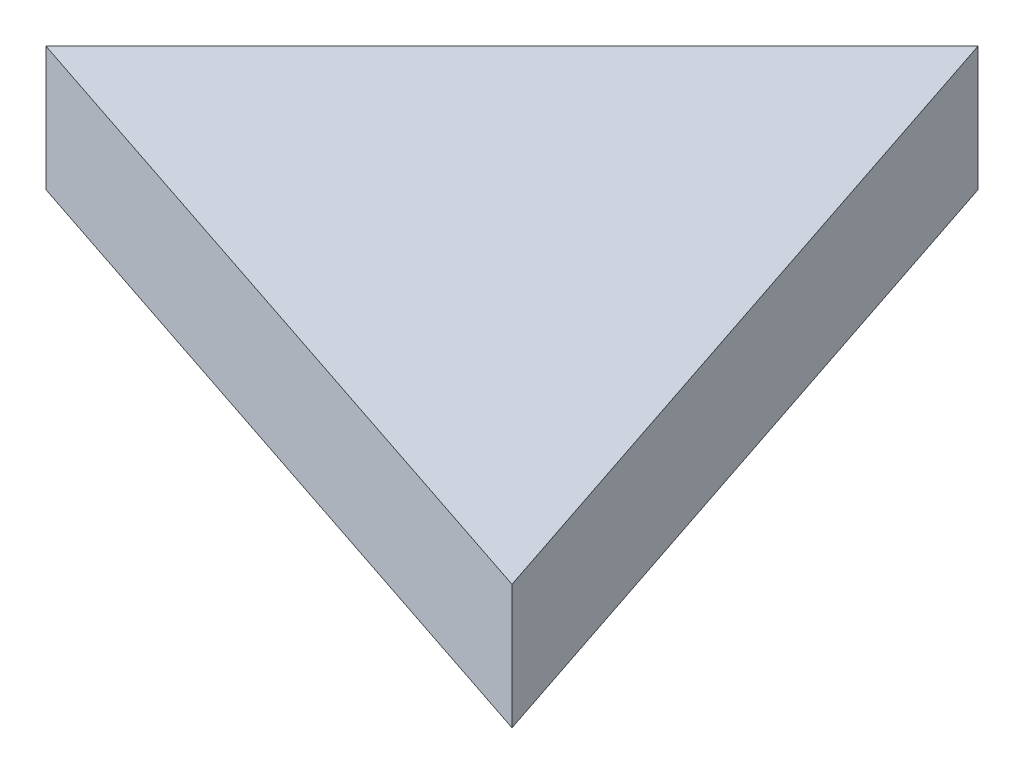
ISO-10303-21;
HEADER;
FILE_DESCRIPTION(('STEP AP214'),'2;1');
FILE_NAME('part.step','',(''),(''),'','','');
FILE_SCHEMA(('AUTOMOTIVE_DESIGN { 1 0 10303 214 1 1 1 1 }'));
ENDSEC;
DATA;
#1=APPLICATION_CONTEXT('core data for automotive mechanical design processes');
#2=APPLICATION_PROTOCOL_DEFINITION('international standard','automotive_design',2000,#1);
#3=PRODUCT_CONTEXT('',#1,'mechanical');
#4=PRODUCT('Part','Part','',(#3));
#5=PRODUCT_RELATED_PRODUCT_CATEGORY('part','',(#4));
#6=PRODUCT_DEFINITION_FORMATION('','',#4);
#7=PRODUCT_DEFINITION_CONTEXT('part definition',#1,'design');
#8=PRODUCT_DEFINITION('design','',#6,#7);
#9=PRODUCT_DEFINITION_SHAPE('','',#8);
#10=(LENGTH_UNIT() NAMED_UNIT(*) SI_UNIT(.MILLI.,.METRE.));
#11=(NAMED_UNIT(*) PLANE_ANGLE_UNIT() SI_UNIT($,.RADIAN.));
#12=(NAMED_UNIT(*) SI_UNIT($,.STERADIAN.) SOLID_ANGLE_UNIT());
#13=UNCERTAINTY_MEASURE_WITH_UNIT(LENGTH_MEASURE(1.E-05),#10,'distance_accuracy_value','');
#14=(GEOMETRIC_REPRESENTATION_CONTEXT(3) GLOBAL_UNCERTAINTY_ASSIGNED_CONTEXT((#13)) GLOBAL_UNIT_ASSIGNED_CONTEXT((#10,
#11,#12)) REPRESENTATION_CONTEXT('',''));
#15=CARTESIAN_POINT('',(0.,0.,0.));
#16=DIRECTION('',(0.,0.,1.));
#17=DIRECTION('',(1.,0.,0.));
#18=AXIS2_PLACEMENT_3D('',#15,#16,#17);
#19=CARTESIAN_POINT('',(0.,0.,0.));
#20=DIRECTION('',(0.,1.,0.));
#21=DIRECTION('',(0.,0.,1.));
#22=AXIS2_PLACEMENT_3D('',#19,#20,#21);
#23=PLANE('',#22);
#24=DIRECTION('',(-0.707106781186548,0.,0.707106781186548));
#25=VECTOR('',#24,1.);
#26=CARTESIAN_POINT('',(-10.,0.,-10.));
#27=LINE('',#26,#25);
#28=CARTESIAN_POINT('',(52.,0.,-72.));
#29=VERTEX_POINT('',#28);
#30=CARTESIAN_POINT('',(28.0000000000001,0.,-48.0000000000001));
#31=VERTEX_POINT('',#30);
#32=EDGE_CURVE('E52',#29,#31,#27,.T.);
#33=ORIENTED_EDGE('',*,*,#32,.F.);
#34=DIRECTION('',(0.316227766016841,0.,0.948683298050513));
#35=VECTOR('',#34,1.);
#36=CARTESIAN_POINT('',(68.4000000000001,0.,-22.8000000000003));
#37=LINE('',#36,#35);
#38=CARTESIAN_POINT('',(64.0000000000001,0.,-36.));
#39=VERTEX_POINT('',#38);
#40=EDGE_CURVE('E53',#29,#39,#37,.T.);
#41=ORIENTED_EDGE('',*,*,#40,.T.);
#42=DIRECTION('',(-0.948683298050513,0.,-0.316227766016841));
#43=VECTOR('',#42,1.);
#44=CARTESIAN_POINT('',(17.2000000000003,0.,-51.6000000000001));
#45=LINE('',#44,#43);
#46=EDGE_CURVE('E20',#39,#31,#45,.T.);
#47=ORIENTED_EDGE('',*,*,#46,.T.);
#48=EDGE_LOOP('',(#33,#41,#47));
#49=FACE_BOUND('',#48,.T.);
#50=ADVANCED_FACE('F17',(#49),#23,.F.);
#51=CARTESIAN_POINT('',(17.2000000000003,6.4,-51.6000000000001));
#52=DIRECTION('',(0.316227766016841,0.,-0.948683298050513));
#53=DIRECTION('',(-0.948683298050513,0.,-0.316227766016841));
#54=AXIS2_PLACEMENT_3D('',#51,#52,#53);
#55=PLANE('',#54);
#56=DIRECTION('',(0.,1.,0.));
#57=VECTOR('',#56,1.);
#58=CARTESIAN_POINT('',(64.0000000000001,6.4,-36.));
#59=LINE('',#58,#57);
#60=CARTESIAN_POINT('',(64.0000000000001,6.4,-36.));
#61=VERTEX_POINT('',#60);
#62=EDGE_CURVE('E56',#39,#61,#59,.T.);
#63=ORIENTED_EDGE('',*,*,#62,.T.);
#64=DIRECTION('',(0.948683298050513,0.,0.316227766016841));
#65=VECTOR('',#64,1.);
#66=CARTESIAN_POINT('',(28.0000000000001,6.4,-48.0000000000001));
#67=LINE('',#66,#65);
#68=CARTESIAN_POINT('',(28.0000000000001,6.4,-48.0000000000001));
#69=VERTEX_POINT('',#68);
#70=EDGE_CURVE('E61',#69,#61,#67,.T.);
#71=ORIENTED_EDGE('',*,*,#70,.F.);
#72=DIRECTION('',(0.,1.,0.));
#73=VECTOR('',#72,1.);
#74=CARTESIAN_POINT('',(28.0000000000001,6.4,-48.0000000000001));
#75=LINE('',#74,#73);
#76=EDGE_CURVE('E58',#31,#69,#75,.T.);
#77=ORIENTED_EDGE('',*,*,#76,.F.);
#78=ORIENTED_EDGE('',*,*,#46,.F.);
#79=EDGE_LOOP('',(#63,#71,#77,#78));
#80=FACE_BOUND('',#79,.T.);
#81=ADVANCED_FACE('F59',(#80),#55,.F.);
#82=CARTESIAN_POINT('',(68.4000000000001,6.4,-22.8000000000003));
#83=DIRECTION('',(-0.948683298050513,0.,0.316227766016841));
#84=DIRECTION('',(0.316227766016841,0.,0.948683298050513));
#85=AXIS2_PLACEMENT_3D('',#82,#83,#84);
#86=PLANE('',#85);
#87=DIRECTION('',(0.,1.,0.));
#88=VECTOR('',#87,1.);
#89=CARTESIAN_POINT('',(52.,6.4,-72.));
#90=LINE('',#89,#88);
#91=CARTESIAN_POINT('',(52.,6.4,-72.));
#92=VERTEX_POINT('',#91);
#93=EDGE_CURVE('E35',#92,#29,#90,.F.);
#94=ORIENTED_EDGE('',*,*,#93,.F.);
#95=DIRECTION('',(-0.316227766016841,0.,-0.948683298050512));
#96=VECTOR('',#95,1.);
#97=CARTESIAN_POINT('',(64.0000000000001,6.4,-36.));
#98=LINE('',#97,#96);
#99=EDGE_CURVE('E26',#61,#92,#98,.T.);
#100=ORIENTED_EDGE('',*,*,#99,.F.);
#101=ORIENTED_EDGE('',*,*,#62,.F.);
#102=ORIENTED_EDGE('',*,*,#40,.F.);
#103=EDGE_LOOP('',(#94,#100,#101,#102));
#104=FACE_BOUND('',#103,.T.);
#105=ADVANCED_FACE('F69',(#104),#86,.F.);
#106=CARTESIAN_POINT('',(-10.,6.4,-10.));
#107=DIRECTION('',(-0.707106781186548,0.,-0.707106781186548));
#108=DIRECTION('',(-0.707106781186548,0.,0.707106781186548));
#109=AXIS2_PLACEMENT_3D('',#106,#107,#108);
#110=PLANE('',#109);
#111=DIRECTION('',(-0.707106781186548,0.,0.707106781186547));
#112=VECTOR('',#111,1.);
#113=CARTESIAN_POINT('',(52.,6.4,-72.));
#114=LINE('',#113,#112);
#115=EDGE_CURVE('E11',#92,#69,#114,.T.);
#116=ORIENTED_EDGE('',*,*,#115,.F.);
#117=ORIENTED_EDGE('',*,*,#93,.T.);
#118=ORIENTED_EDGE('',*,*,#32,.T.);
#119=ORIENTED_EDGE('',*,*,#76,.T.);
#120=EDGE_LOOP('',(#116,#117,#118,#119));
#121=FACE_BOUND('',#120,.T.);
#122=ADVANCED_FACE('F64',(#121),#110,.T.);
#123=CARTESIAN_POINT('',(0.,6.4,0.));
#124=DIRECTION('',(0.,1.,0.));
#125=DIRECTION('',(0.,0.,1.));
#126=AXIS2_PLACEMENT_3D('',#123,#124,#125);
#127=PLANE('',#126);
#128=ORIENTED_EDGE('',*,*,#99,.T.);
#129=ORIENTED_EDGE('',*,*,#115,.T.);
#130=ORIENTED_EDGE('',*,*,#70,.T.);
#131=EDGE_LOOP('',(#128,#129,#130));
#132=FACE_BOUND('',#131,.T.);
#133=ADVANCED_FACE('F72',(#132),#127,.T.);
#134=CLOSED_SHELL('',(#50,#81,#105,#122,#133));
#135=MANIFOLD_SOLID_BREP('B1',#134);
#136=ADVANCED_BREP_SHAPE_REPRESENTATION('',(#18,#135),#14);
#137=SHAPE_DEFINITION_REPRESENTATION(#9,#136);
ENDSEC;
END-ISO-10303-21;
